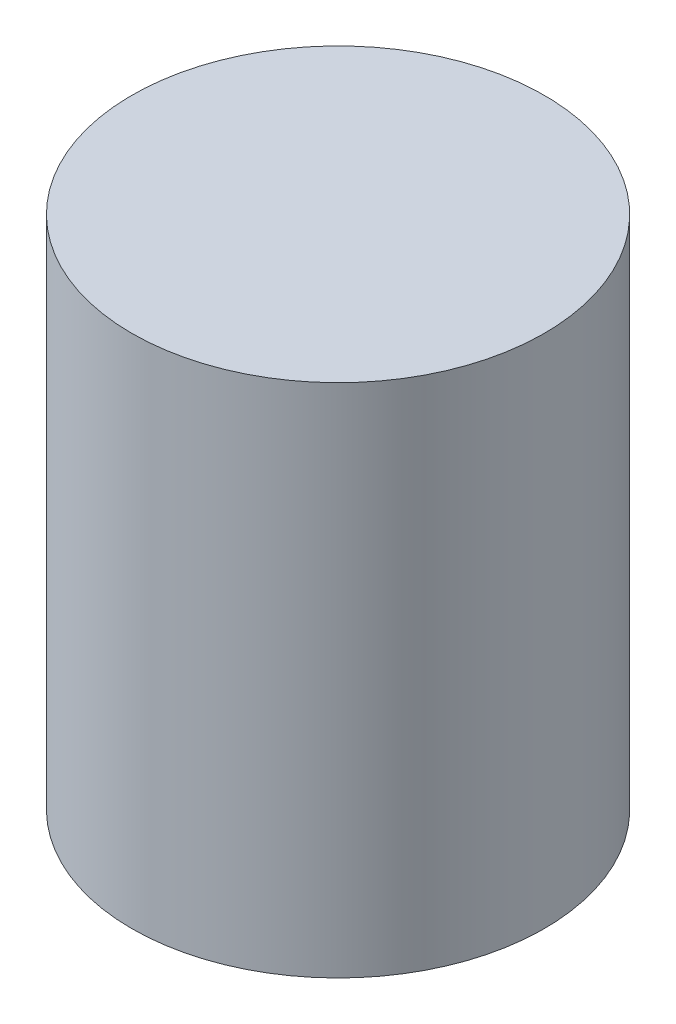
ISO-10303-21;
HEADER;
FILE_DESCRIPTION(('STEP AP214'),'2;1');
FILE_NAME('part.step','',(''),(''),'','','');
FILE_SCHEMA(('AUTOMOTIVE_DESIGN { 1 0 10303 214 1 1 1 1 }'));
ENDSEC;
DATA;
#1=APPLICATION_CONTEXT('core data for automotive mechanical design processes');
#2=APPLICATION_PROTOCOL_DEFINITION('international standard','automotive_design',2000,#1);
#3=PRODUCT_CONTEXT('',#1,'mechanical');
#4=PRODUCT('Part','Part','',(#3));
#5=PRODUCT_RELATED_PRODUCT_CATEGORY('part','',(#4));
#6=PRODUCT_DEFINITION_FORMATION('','',#4);
#7=PRODUCT_DEFINITION_CONTEXT('part definition',#1,'design');
#8=PRODUCT_DEFINITION('design','',#6,#7);
#9=PRODUCT_DEFINITION_SHAPE('','',#8);
#10=(LENGTH_UNIT() NAMED_UNIT(*) SI_UNIT(.MILLI.,.METRE.));
#11=(NAMED_UNIT(*) PLANE_ANGLE_UNIT() SI_UNIT($,.RADIAN.));
#12=(NAMED_UNIT(*) SI_UNIT($,.STERADIAN.) SOLID_ANGLE_UNIT());
#13=UNCERTAINTY_MEASURE_WITH_UNIT(LENGTH_MEASURE(1.E-05),#10,'distance_accuracy_value','');
#14=(GEOMETRIC_REPRESENTATION_CONTEXT(3) GLOBAL_UNCERTAINTY_ASSIGNED_CONTEXT((#13)) GLOBAL_UNIT_ASSIGNED_CONTEXT((#10,
#11,#12)) REPRESENTATION_CONTEXT('',''));
#15=CARTESIAN_POINT('',(0.,0.,0.));
#16=DIRECTION('',(0.,0.,1.));
#17=DIRECTION('',(1.,0.,0.));
#18=AXIS2_PLACEMENT_3D('',#15,#16,#17);
#19=CARTESIAN_POINT('',(0.,50.,0.));
#20=DIRECTION('',(0.,-1.,0.));
#21=DIRECTION('',(0.,0.,-1.));
#22=AXIS2_PLACEMENT_3D('',#19,#20,#21);
#23=CYLINDRICAL_SURFACE('',#22,20.);
#24=CARTESIAN_POINT('',(0.,50.,0.));
#25=DIRECTION('',(0.,1.,0.));
#26=DIRECTION('',(0.,0.,1.));
#27=AXIS2_PLACEMENT_3D('',#24,#25,#26);
#28=CIRCLE('',#27,20.);
#29=CARTESIAN_POINT('',(0.,50.,20.));
#30=VERTEX_POINT('',#29);
#31=EDGE_CURVE('E10',#30,#30,#28,.T.);
#32=ORIENTED_EDGE('',*,*,#31,.F.);
#33=EDGE_LOOP('',(#32));
#34=FACE_BOUND('',#33,.T.);
#35=CARTESIAN_POINT('',(0.,0.,0.));
#36=DIRECTION('',(0.,1.,0.));
#37=DIRECTION('',(0.,0.,1.));
#38=AXIS2_PLACEMENT_3D('',#35,#36,#37);
#39=CIRCLE('',#38,20.);
#40=CARTESIAN_POINT('',(0.,0.,20.));
#41=VERTEX_POINT('',#40);
#42=EDGE_CURVE('E36',#41,#41,#39,.T.);
#43=ORIENTED_EDGE('',*,*,#42,.T.);
#44=EDGE_LOOP('',(#43));
#45=FACE_BOUND('',#44,.T.);
#46=ADVANCED_FACE('F33',(#34,#45),#23,.T.);
#47=CARTESIAN_POINT('',(0.,50.,0.));
#48=DIRECTION('',(0.,1.,0.));
#49=DIRECTION('',(0.,0.,1.));
#50=AXIS2_PLACEMENT_3D('',#47,#48,#49);
#51=PLANE('',#50);
#52=ORIENTED_EDGE('',*,*,#31,.T.);
#53=EDGE_LOOP('',(#52));
#54=FACE_BOUND('',#53,.T.);
#55=ADVANCED_FACE('F48',(#54),#51,.T.);
#56=CARTESIAN_POINT('',(0.,0.,0.));
#57=DIRECTION('',(0.,1.,0.));
#58=DIRECTION('',(0.,0.,1.));
#59=AXIS2_PLACEMENT_3D('',#56,#57,#58);
#60=PLANE('',#59);
#61=ORIENTED_EDGE('',*,*,#42,.F.);
#62=EDGE_LOOP('',(#61));
#63=FACE_BOUND('',#62,.T.);
#64=ADVANCED_FACE('F46',(#63),#60,.F.);
#65=CLOSED_SHELL('',(#46,#55,#64));
#66=MANIFOLD_SOLID_BREP('B2',#65);
#67=ADVANCED_BREP_SHAPE_REPRESENTATION('',(#18,#66),#14);
#68=SHAPE_DEFINITION_REPRESENTATION(#9,#67);
ENDSEC;
END-ISO-10303-21;
